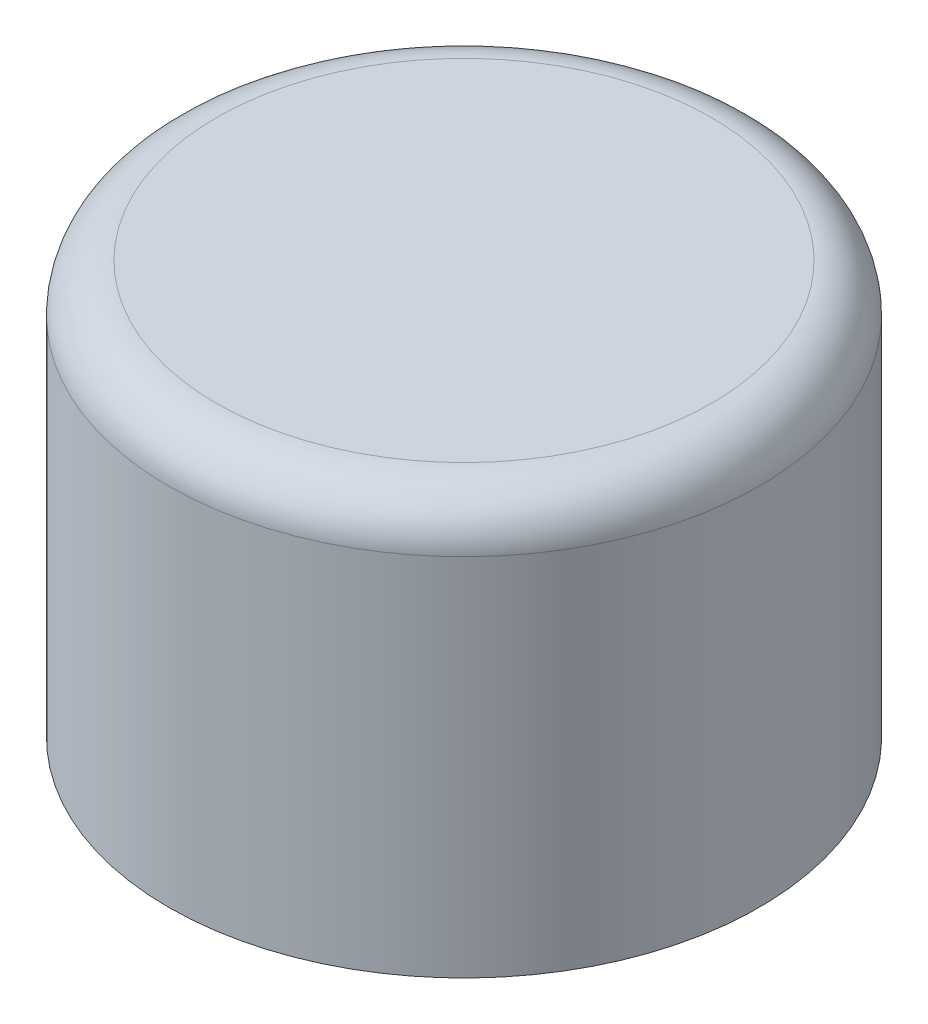
ISO-10303-21;
HEADER;
FILE_DESCRIPTION(('STEP AP214'),'2;1');
FILE_NAME('part.step','',(''),(''),'','','');
FILE_SCHEMA(('AUTOMOTIVE_DESIGN { 1 0 10303 214 1 1 1 1 }'));
ENDSEC;
DATA;
#1=APPLICATION_CONTEXT('core data for automotive mechanical design processes');
#2=APPLICATION_PROTOCOL_DEFINITION('international standard','automotive_design',2000,#1);
#3=PRODUCT_CONTEXT('',#1,'mechanical');
#4=PRODUCT('Part','Part','',(#3));
#5=PRODUCT_RELATED_PRODUCT_CATEGORY('part','',(#4));
#6=PRODUCT_DEFINITION_FORMATION('','',#4);
#7=PRODUCT_DEFINITION_CONTEXT('part definition',#1,'design');
#8=PRODUCT_DEFINITION('design','',#6,#7);
#9=PRODUCT_DEFINITION_SHAPE('','',#8);
#10=(LENGTH_UNIT() NAMED_UNIT(*) SI_UNIT(.MILLI.,.METRE.));
#11=(NAMED_UNIT(*) PLANE_ANGLE_UNIT() SI_UNIT($,.RADIAN.));
#12=(NAMED_UNIT(*) SI_UNIT($,.STERADIAN.) SOLID_ANGLE_UNIT());
#13=UNCERTAINTY_MEASURE_WITH_UNIT(LENGTH_MEASURE(1.E-05),#10,'distance_accuracy_value','');
#14=(GEOMETRIC_REPRESENTATION_CONTEXT(3) GLOBAL_UNCERTAINTY_ASSIGNED_CONTEXT((#13)) GLOBAL_UNIT_ASSIGNED_CONTEXT((#10,
#11,#12)) REPRESENTATION_CONTEXT('',''));
#15=CARTESIAN_POINT('',(0.,0.,0.));
#16=DIRECTION('',(0.,0.,1.));
#17=DIRECTION('',(1.,0.,0.));
#18=AXIS2_PLACEMENT_3D('',#15,#16,#17);
#19=CARTESIAN_POINT('',(0.,-1.,0.));
#20=DIRECTION('',(0.,1.,0.));
#21=DIRECTION('',(0.,0.,1.));
#22=AXIS2_PLACEMENT_3D('',#19,#20,#21);
#23=PLANE('',#22);
#24=CARTESIAN_POINT('',(0.,-1.,0.));
#25=DIRECTION('',(0.,1.,0.));
#26=DIRECTION('',(0.,0.,1.));
#27=AXIS2_PLACEMENT_3D('',#24,#25,#26);
#28=CIRCLE('',#27,4.);
#29=CARTESIAN_POINT('',(0.,-1.,4.));
#30=VERTEX_POINT('',#29);
#31=EDGE_CURVE('E12',#30,#30,#28,.F.);
#32=ORIENTED_EDGE('',*,*,#31,.F.);
#33=EDGE_LOOP('',(#32));
#34=FACE_BOUND('',#33,.T.);
#35=CARTESIAN_POINT('',(0.,-1.,0.));
#36=DIRECTION('',(0.,1.,0.));
#37=DIRECTION('',(0.,0.,1.));
#38=AXIS2_PLACEMENT_3D('',#35,#36,#37);
#39=CIRCLE('',#38,8.9984);
#40=CARTESIAN_POINT('',(0.,-1.,8.9984));
#41=VERTEX_POINT('',#40);
#42=EDGE_CURVE('E139',#41,#41,#39,.T.);
#43=ORIENTED_EDGE('',*,*,#42,.F.);
#44=EDGE_LOOP('',(#43));
#45=FACE_BOUND('',#44,.T.);
#46=ADVANCED_FACE('F96',(#34,#45),#23,.F.);
#47=CARTESIAN_POINT('',(0.,-15.,0.));
#48=DIRECTION('',(0.,-1.,0.));
#49=DIRECTION('',(0.,0.,-1.));
#50=AXIS2_PLACEMENT_3D('',#47,#48,#49);
#51=PLANE('',#50);
#52=CARTESIAN_POINT('',(0.,-15.,0.));
#53=DIRECTION('',(0.,1.,0.));
#54=DIRECTION('',(0.,0.,1.));
#55=AXIS2_PLACEMENT_3D('',#52,#53,#54);
#56=CIRCLE('',#55,9.735);
#57=CARTESIAN_POINT('',(0.,-15.,9.735));
#58=VERTEX_POINT('',#57);
#59=EDGE_CURVE('E135',#58,#58,#56,.T.);
#60=ORIENTED_EDGE('',*,*,#59,.T.);
#61=EDGE_LOOP('',(#60));
#62=FACE_BOUND('',#61,.T.);
#63=CARTESIAN_POINT('',(0.,-15.,0.));
#64=DIRECTION('',(0.,1.,0.));
#65=DIRECTION('',(0.,0.,1.));
#66=AXIS2_PLACEMENT_3D('',#63,#64,#65);
#67=CIRCLE('',#66,10.735);
#68=CARTESIAN_POINT('',(0.,-15.,10.735));
#69=VERTEX_POINT('',#68);
#70=EDGE_CURVE('E136',#69,#69,#67,.T.);
#71=ORIENTED_EDGE('',*,*,#70,.F.);
#72=EDGE_LOOP('',(#71));
#73=FACE_BOUND('',#72,.T.);
#74=ADVANCED_FACE('F133',(#62,#73),#51,.T.);
#75=CARTESIAN_POINT('',(0.,-1.,0.));
#76=DIRECTION('',(0.,1.,0.));
#77=DIRECTION('',(0.,0.,1.));
#78=AXIS2_PLACEMENT_3D('',#75,#76,#77);
#79=CYLINDRICAL_SURFACE('',#78,10.735);
#80=DIRECTION('',(0.,1.,0.));
#81=VECTOR('',#80,1.);
#82=CARTESIAN_POINT('',(0.,-1.,10.735));
#83=LINE('',#82,#81);
#84=CARTESIAN_POINT('',(0.,-1.7366,10.735));
#85=VERTEX_POINT('',#84);
#86=EDGE_CURVE('E208',#85,#69,#83,.F.);
#87=ORIENTED_EDGE('',*,*,#86,.F.);
#88=CARTESIAN_POINT('',(0.,-1.7366,0.));
#89=DIRECTION('',(0.,1.,0.));
#90=DIRECTION('',(0.,0.,1.));
#91=AXIS2_PLACEMENT_3D('',#88,#89,#90);
#92=CIRCLE('',#91,10.735);
#93=EDGE_CURVE('E211',#85,#85,#92,.T.);
#94=ORIENTED_EDGE('',*,*,#93,.F.);
#95=ORIENTED_EDGE('',*,*,#86,.T.);
#96=ORIENTED_EDGE('',*,*,#70,.T.);
#97=EDGE_LOOP('',(#87,#94,#95,#96));
#98=FACE_BOUND('',#97,.T.);
#99=ADVANCED_FACE('F182',(#98),#79,.T.);
#100=CARTESIAN_POINT('',(0.,-1.7366,0.));
#101=DIRECTION('',(0.,1.,0.));
#102=DIRECTION('',(0.,0.,1.));
#103=AXIS2_PLACEMENT_3D('',#100,#101,#102);
#104=TOROIDAL_SURFACE('',#103,8.9984,1.7366);
#105=CARTESIAN_POINT('',(0.,-1.7366,8.9984));
#106=DIRECTION('',(-1.,0.,0.));
#107=DIRECTION('',(0.,0.,1.));
#108=AXIS2_PLACEMENT_3D('',#105,#106,#107);
#109=CIRCLE('',#108,1.7366);
#110=CARTESIAN_POINT('',(0.,0.,8.9984));
#111=VERTEX_POINT('',#110);
#112=EDGE_CURVE('E155',#111,#85,#109,.F.);
#113=ORIENTED_EDGE('',*,*,#112,.F.);
#114=CARTESIAN_POINT('',(0.,0.,0.));
#115=DIRECTION('',(0.,1.,0.));
#116=DIRECTION('',(0.,0.,1.));
#117=AXIS2_PLACEMENT_3D('',#114,#115,#116);
#118=CIRCLE('',#117,8.9984);
#119=EDGE_CURVE('E106',#111,#111,#118,.F.);
#120=ORIENTED_EDGE('',*,*,#119,.T.);
#121=ORIENTED_EDGE('',*,*,#112,.T.);
#122=ORIENTED_EDGE('',*,*,#93,.T.);
#123=EDGE_LOOP('',(#113,#120,#121,#122));
#124=FACE_BOUND('',#123,.T.);
#125=ADVANCED_FACE('F163',(#124),#104,.T.);
#126=CARTESIAN_POINT('',(0.,-1.,0.));
#127=DIRECTION('',(0.,1.,0.));
#128=DIRECTION('',(0.,0.,1.));
#129=AXIS2_PLACEMENT_3D('',#126,#127,#128);
#130=CYLINDRICAL_SURFACE('',#129,9.735);
#131=DIRECTION('',(0.,-1.,0.));
#132=VECTOR('',#131,1.);
#133=CARTESIAN_POINT('',(0.,-1.,9.735));
#134=LINE('',#133,#132);
#135=CARTESIAN_POINT('',(0.,-1.7366,9.735));
#136=VERTEX_POINT('',#135);
#137=EDGE_CURVE('E143',#136,#58,#134,.T.);
#138=ORIENTED_EDGE('',*,*,#137,.T.);
#139=ORIENTED_EDGE('',*,*,#59,.F.);
#140=ORIENTED_EDGE('',*,*,#137,.F.);
#141=CARTESIAN_POINT('',(0.,-1.7366,0.));
#142=DIRECTION('',(0.,1.,0.));
#143=DIRECTION('',(0.,0.,1.));
#144=AXIS2_PLACEMENT_3D('',#141,#142,#143);
#145=CIRCLE('',#144,9.735);
#146=EDGE_CURVE('E145',#136,#136,#145,.T.);
#147=ORIENTED_EDGE('',*,*,#146,.T.);
#148=EDGE_LOOP('',(#138,#139,#140,#147));
#149=FACE_BOUND('',#148,.T.);
#150=ADVANCED_FACE('F144',(#149),#130,.F.);
#151=CARTESIAN_POINT('',(0.,-1.7366,0.));
#152=DIRECTION('',(0.,1.,0.));
#153=DIRECTION('',(0.,0.,1.));
#154=AXIS2_PLACEMENT_3D('',#151,#152,#153);
#155=TOROIDAL_SURFACE('',#154,8.9984,0.7366);
#156=CARTESIAN_POINT('',(0.,-1.7366,8.9984));
#157=DIRECTION('',(-1.,0.,0.));
#158=DIRECTION('',(0.,0.,1.));
#159=AXIS2_PLACEMENT_3D('',#156,#157,#158);
#160=CIRCLE('',#159,0.7366);
#161=EDGE_CURVE('E130',#41,#136,#160,.F.);
#162=ORIENTED_EDGE('',*,*,#161,.T.);
#163=ORIENTED_EDGE('',*,*,#146,.F.);
#164=ORIENTED_EDGE('',*,*,#161,.F.);
#165=ORIENTED_EDGE('',*,*,#42,.T.);
#166=EDGE_LOOP('',(#162,#163,#164,#165));
#167=FACE_BOUND('',#166,.T.);
#168=ADVANCED_FACE('F167',(#167),#155,.F.);
#169=CARTESIAN_POINT('',(0.,0.,0.));
#170=DIRECTION('',(0.,1.,0.));
#171=DIRECTION('',(0.,0.,1.));
#172=AXIS2_PLACEMENT_3D('',#169,#170,#171);
#173=PLANE('',#172);
#174=ORIENTED_EDGE('',*,*,#119,.F.);
#175=EDGE_LOOP('',(#174));
#176=FACE_BOUND('',#175,.T.);
#177=ADVANCED_FACE('F98',(#176),#173,.T.);
#178=CARTESIAN_POINT('',(0.,-5.,0.));
#179=DIRECTION('',(0.,-1.,0.));
#180=DIRECTION('',(0.,0.,-1.));
#181=AXIS2_PLACEMENT_3D('',#178,#179,#180);
#182=PLANE('',#181);
#183=CARTESIAN_POINT('',(0.,-5.,0.));
#184=DIRECTION('',(0.,-1.,0.));
#185=DIRECTION('',(0.,0.,-1.));
#186=AXIS2_PLACEMENT_3D('',#183,#184,#185);
#187=CIRCLE('',#186,4.);
#188=CARTESIAN_POINT('',(0.,-5.,-4.));
#189=VERTEX_POINT('',#188);
#190=EDGE_CURVE('E151',#189,#189,#187,.T.);
#191=ORIENTED_EDGE('',*,*,#190,.T.);
#192=EDGE_LOOP('',(#191));
#193=FACE_BOUND('',#192,.T.);
#194=CARTESIAN_POINT('',(0.,-5.,0.));
#195=DIRECTION('',(0.,-1.,0.));
#196=DIRECTION('',(0.,0.,-1.));
#197=AXIS2_PLACEMENT_3D('',#194,#195,#196);
#198=CIRCLE('',#197,2.5);
#199=CARTESIAN_POINT('',(0.,-5.,-2.5));
#200=VERTEX_POINT('',#199);
#201=EDGE_CURVE('E199',#200,#200,#198,.T.);
#202=ORIENTED_EDGE('',*,*,#201,.F.);
#203=EDGE_LOOP('',(#202));
#204=FACE_BOUND('',#203,.T.);
#205=ADVANCED_FACE('F166',(#193,#204),#182,.T.);
#206=CARTESIAN_POINT('',(0.,-5.,0.));
#207=DIRECTION('',(0.,1.,0.));
#208=DIRECTION('',(0.,0.,1.));
#209=AXIS2_PLACEMENT_3D('',#206,#207,#208);
#210=CYLINDRICAL_SURFACE('',#209,4.);
#211=ORIENTED_EDGE('',*,*,#190,.F.);
#212=EDGE_LOOP('',(#211));
#213=FACE_BOUND('',#212,.T.);
#214=ORIENTED_EDGE('',*,*,#31,.T.);
#215=EDGE_LOOP('',(#214));
#216=FACE_BOUND('',#215,.T.);
#217=ADVANCED_FACE('F172',(#213,#216),#210,.T.);
#218=CARTESIAN_POINT('',(0.,-5.,0.));
#219=DIRECTION('',(0.,1.,0.));
#220=DIRECTION('',(0.,0.,1.));
#221=AXIS2_PLACEMENT_3D('',#218,#219,#220);
#222=CYLINDRICAL_SURFACE('',#221,2.5);
#223=ORIENTED_EDGE('',*,*,#201,.T.);
#224=EDGE_LOOP('',(#223));
#225=FACE_BOUND('',#224,.T.);
#226=CARTESIAN_POINT('',(0.,-1.,0.));
#227=DIRECTION('',(0.,-1.,0.));
#228=DIRECTION('',(0.,0.,-1.));
#229=AXIS2_PLACEMENT_3D('',#226,#227,#228);
#230=CIRCLE('',#229,2.5);
#231=CARTESIAN_POINT('',(0.,-1.,-2.5));
#232=VERTEX_POINT('',#231);
#233=EDGE_CURVE('E196',#232,#232,#230,.T.);
#234=ORIENTED_EDGE('',*,*,#233,.F.);
#235=EDGE_LOOP('',(#234));
#236=FACE_BOUND('',#235,.T.);
#237=ADVANCED_FACE('F187',(#225,#236),#222,.F.);
#238=ORIENTED_EDGE('',*,*,#233,.T.);
#239=EDGE_LOOP('',(#238));
#240=FACE_BOUND('',#239,.T.);
#241=ADVANCED_FACE('F178',(#240),#23,.F.);
#242=CLOSED_SHELL('',(#46,#74,#99,#125,#150,#168,#177,#205,#217,#237,#241));
#243=MANIFOLD_SOLID_BREP('B2',#242);
#244=ADVANCED_BREP_SHAPE_REPRESENTATION('',(#18,#243),#14);
#245=SHAPE_DEFINITION_REPRESENTATION(#9,#244);
ENDSEC;
END-ISO-10303-21;
